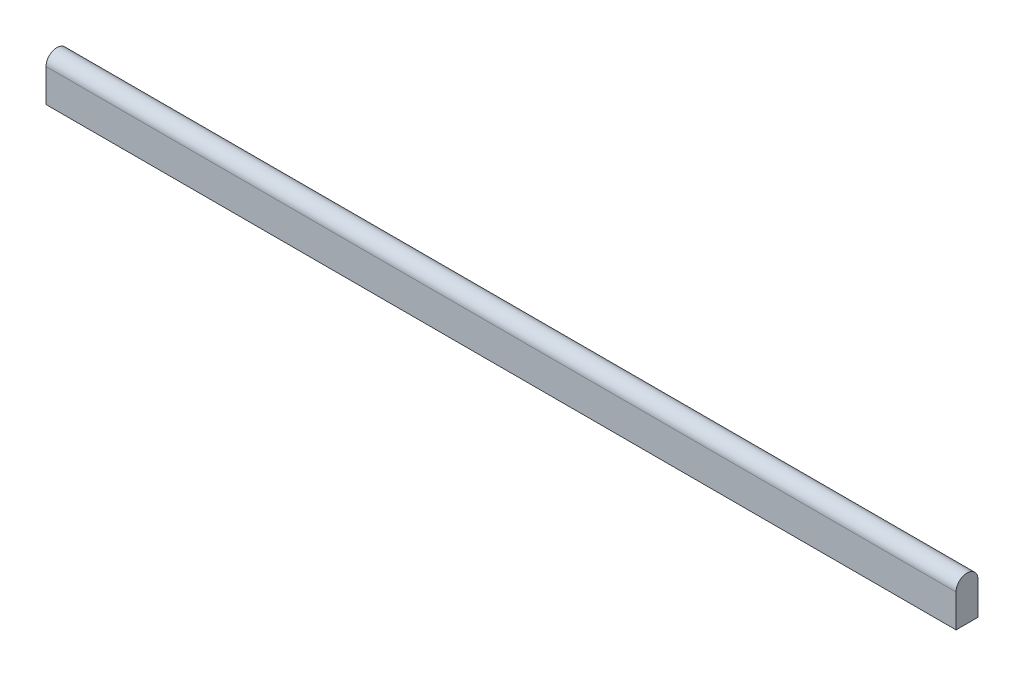
ISO-10303-21;
HEADER;
FILE_DESCRIPTION(('STEP AP214'),'2;1');
FILE_NAME('part.step','',(''),(''),'','','');
FILE_SCHEMA(('AUTOMOTIVE_DESIGN { 1 0 10303 214 1 1 1 1 }'));
ENDSEC;
DATA;
#1=APPLICATION_CONTEXT('core data for automotive mechanical design processes');
#2=APPLICATION_PROTOCOL_DEFINITION('international standard','automotive_design',2000,#1);
#3=PRODUCT_CONTEXT('',#1,'mechanical');
#4=PRODUCT('Part','Part','',(#3));
#5=PRODUCT_RELATED_PRODUCT_CATEGORY('part','',(#4));
#6=PRODUCT_DEFINITION_FORMATION('','',#4);
#7=PRODUCT_DEFINITION_CONTEXT('part definition',#1,'design');
#8=PRODUCT_DEFINITION('design','',#6,#7);
#9=PRODUCT_DEFINITION_SHAPE('','',#8);
#10=(LENGTH_UNIT() NAMED_UNIT(*) SI_UNIT(.MILLI.,.METRE.));
#11=(NAMED_UNIT(*) PLANE_ANGLE_UNIT() SI_UNIT($,.RADIAN.));
#12=(NAMED_UNIT(*) SI_UNIT($,.STERADIAN.) SOLID_ANGLE_UNIT());
#13=UNCERTAINTY_MEASURE_WITH_UNIT(LENGTH_MEASURE(1.E-05),#10,'distance_accuracy_value','');
#14=(GEOMETRIC_REPRESENTATION_CONTEXT(3) GLOBAL_UNCERTAINTY_ASSIGNED_CONTEXT((#13)) GLOBAL_UNIT_ASSIGNED_CONTEXT((#10,
#11,#12)) REPRESENTATION_CONTEXT('',''));
#15=CARTESIAN_POINT('',(0.,0.,0.));
#16=DIRECTION('',(0.,0.,1.));
#17=DIRECTION('',(1.,0.,0.));
#18=AXIS2_PLACEMENT_3D('',#15,#16,#17);
#19=CARTESIAN_POINT('',(166.,0.,0.));
#20=DIRECTION('',(-1.,0.,0.));
#21=DIRECTION('',(0.,0.,1.));
#22=AXIS2_PLACEMENT_3D('',#19,#20,#21);
#23=CYLINDRICAL_SURFACE('',#22,2.);
#24=CARTESIAN_POINT('',(0.,0.,0.));
#25=DIRECTION('',(1.,0.,0.));
#26=DIRECTION('',(0.,0.,1.));
#27=AXIS2_PLACEMENT_3D('',#24,#25,#26);
#28=CIRCLE('',#27,2.);
#29=CARTESIAN_POINT('',(0.,0.,-2.));
#30=VERTEX_POINT('',#29);
#31=CARTESIAN_POINT('',(0.,0.,2.));
#32=VERTEX_POINT('',#31);
#33=EDGE_CURVE('E96',#30,#32,#28,.T.);
#34=ORIENTED_EDGE('',*,*,#33,.T.);
#35=DIRECTION('',(-1.,0.,0.));
#36=VECTOR('',#35,1.);
#37=CARTESIAN_POINT('',(166.,0.,2.));
#38=LINE('',#37,#36);
#39=CARTESIAN_POINT('',(166.,0.,2.));
#40=VERTEX_POINT('',#39);
#41=EDGE_CURVE('E11',#40,#32,#38,.T.);
#42=ORIENTED_EDGE('',*,*,#41,.F.);
#43=CARTESIAN_POINT('',(166.,0.,0.));
#44=DIRECTION('',(1.,0.,0.));
#45=DIRECTION('',(0.,0.,1.));
#46=AXIS2_PLACEMENT_3D('',#43,#44,#45);
#47=CIRCLE('',#46,2.);
#48=CARTESIAN_POINT('',(166.,0.,-2.));
#49=VERTEX_POINT('',#48);
#50=EDGE_CURVE('E84',#49,#40,#47,.T.);
#51=ORIENTED_EDGE('',*,*,#50,.F.);
#52=DIRECTION('',(-1.,0.,0.));
#53=VECTOR('',#52,1.);
#54=CARTESIAN_POINT('',(166.,0.,-2.));
#55=LINE('',#54,#53);
#56=EDGE_CURVE('E92',#49,#30,#55,.T.);
#57=ORIENTED_EDGE('',*,*,#56,.T.);
#58=EDGE_LOOP('',(#34,#42,#51,#57));
#59=FACE_BOUND('',#58,.T.);
#60=ADVANCED_FACE('F33',(#59),#23,.T.);
#61=CARTESIAN_POINT('',(166.,0.,2.));
#62=DIRECTION('',(0.,0.,-1.));
#63=DIRECTION('',(0.,1.,0.));
#64=AXIS2_PLACEMENT_3D('',#61,#62,#63);
#65=PLANE('',#64);
#66=DIRECTION('',(0.,-1.,0.));
#67=VECTOR('',#66,1.);
#68=CARTESIAN_POINT('',(0.,0.,2.));
#69=LINE('',#68,#67);
#70=CARTESIAN_POINT('',(0.,-6.,2.));
#71=VERTEX_POINT('',#70);
#72=EDGE_CURVE('E88',#32,#71,#69,.T.);
#73=ORIENTED_EDGE('',*,*,#72,.T.);
#74=DIRECTION('',(-1.,0.,0.));
#75=VECTOR('',#74,1.);
#76=CARTESIAN_POINT('',(166.,-6.,2.));
#77=LINE('',#76,#75);
#78=CARTESIAN_POINT('',(166.,-6.,2.));
#79=VERTEX_POINT('',#78);
#80=EDGE_CURVE('E41',#79,#71,#77,.T.);
#81=ORIENTED_EDGE('',*,*,#80,.F.);
#82=DIRECTION('',(0.,-1.,0.));
#83=VECTOR('',#82,1.);
#84=CARTESIAN_POINT('',(166.,0.,2.));
#85=LINE('',#84,#83);
#86=EDGE_CURVE('E79',#40,#79,#85,.T.);
#87=ORIENTED_EDGE('',*,*,#86,.F.);
#88=ORIENTED_EDGE('',*,*,#41,.T.);
#89=EDGE_LOOP('',(#73,#81,#87,#88));
#90=FACE_BOUND('',#89,.T.);
#91=ADVANCED_FACE('F87',(#90),#65,.F.);
#92=CARTESIAN_POINT('',(166.,-6.,2.));
#93=DIRECTION('',(0.,1.,0.));
#94=DIRECTION('',(0.,0.,1.));
#95=AXIS2_PLACEMENT_3D('',#92,#93,#94);
#96=PLANE('',#95);
#97=DIRECTION('',(0.,0.,-1.));
#98=VECTOR('',#97,1.);
#99=CARTESIAN_POINT('',(0.,-6.,2.));
#100=LINE('',#99,#98);
#101=CARTESIAN_POINT('',(0.,-6.,-2.));
#102=VERTEX_POINT('',#101);
#103=EDGE_CURVE('E66',#71,#102,#100,.T.);
#104=ORIENTED_EDGE('',*,*,#103,.T.);
#105=DIRECTION('',(-1.,0.,0.));
#106=VECTOR('',#105,1.);
#107=CARTESIAN_POINT('',(166.,-6.,-2.));
#108=LINE('',#107,#106);
#109=CARTESIAN_POINT('',(166.,-6.,-2.));
#110=VERTEX_POINT('',#109);
#111=EDGE_CURVE('E89',#110,#102,#108,.T.);
#112=ORIENTED_EDGE('',*,*,#111,.F.);
#113=DIRECTION('',(0.,0.,-1.));
#114=VECTOR('',#113,1.);
#115=CARTESIAN_POINT('',(166.,-6.,2.));
#116=LINE('',#115,#114);
#117=EDGE_CURVE('E82',#79,#110,#116,.T.);
#118=ORIENTED_EDGE('',*,*,#117,.F.);
#119=ORIENTED_EDGE('',*,*,#80,.T.);
#120=EDGE_LOOP('',(#104,#112,#118,#119));
#121=FACE_BOUND('',#120,.T.);
#122=ADVANCED_FACE('F90',(#121),#96,.F.);
#123=CARTESIAN_POINT('',(166.,-6.,-2.));
#124=DIRECTION('',(0.,0.,1.));
#125=DIRECTION('',(0.,-1.,0.));
#126=AXIS2_PLACEMENT_3D('',#123,#124,#125);
#127=PLANE('',#126);
#128=DIRECTION('',(0.,1.,0.));
#129=VECTOR('',#128,1.);
#130=CARTESIAN_POINT('',(0.,-6.,-2.));
#131=LINE('',#130,#129);
#132=EDGE_CURVE('E72',#102,#30,#131,.T.);
#133=ORIENTED_EDGE('',*,*,#132,.T.);
#134=ORIENTED_EDGE('',*,*,#56,.F.);
#135=DIRECTION('',(0.,1.,0.));
#136=VECTOR('',#135,1.);
#137=CARTESIAN_POINT('',(166.,-6.,-2.));
#138=LINE('',#137,#136);
#139=EDGE_CURVE('E49',#110,#49,#138,.T.);
#140=ORIENTED_EDGE('',*,*,#139,.F.);
#141=ORIENTED_EDGE('',*,*,#111,.T.);
#142=EDGE_LOOP('',(#133,#134,#140,#141));
#143=FACE_BOUND('',#142,.T.);
#144=ADVANCED_FACE('F103',(#143),#127,.F.);
#145=CARTESIAN_POINT('',(166.,0.,0.));
#146=DIRECTION('',(-1.,0.,0.));
#147=DIRECTION('',(0.,0.,1.));
#148=AXIS2_PLACEMENT_3D('',#145,#146,#147);
#149=PLANE('',#148);
#150=ORIENTED_EDGE('',*,*,#50,.T.);
#151=ORIENTED_EDGE('',*,*,#86,.T.);
#152=ORIENTED_EDGE('',*,*,#117,.T.);
#153=ORIENTED_EDGE('',*,*,#139,.T.);
#154=EDGE_LOOP('',(#150,#151,#152,#153));
#155=FACE_BOUND('',#154,.T.);
#156=ADVANCED_FACE('F80',(#155),#149,.F.);
#157=CARTESIAN_POINT('',(0.,0.,0.));
#158=DIRECTION('',(-1.,0.,0.));
#159=DIRECTION('',(0.,0.,1.));
#160=AXIS2_PLACEMENT_3D('',#157,#158,#159);
#161=PLANE('',#160);
#162=ORIENTED_EDGE('',*,*,#33,.F.);
#163=ORIENTED_EDGE('',*,*,#132,.F.);
#164=ORIENTED_EDGE('',*,*,#103,.F.);
#165=ORIENTED_EDGE('',*,*,#72,.F.);
#166=EDGE_LOOP('',(#162,#163,#164,#165));
#167=FACE_BOUND('',#166,.T.);
#168=ADVANCED_FACE('F106',(#167),#161,.T.);
#169=CLOSED_SHELL('',(#60,#91,#122,#144,#156,#168));
#170=MANIFOLD_SOLID_BREP('B2',#169);
#171=ADVANCED_BREP_SHAPE_REPRESENTATION('',(#18,#170),#14);
#172=SHAPE_DEFINITION_REPRESENTATION(#9,#171);
ENDSEC;
END-ISO-10303-21;
